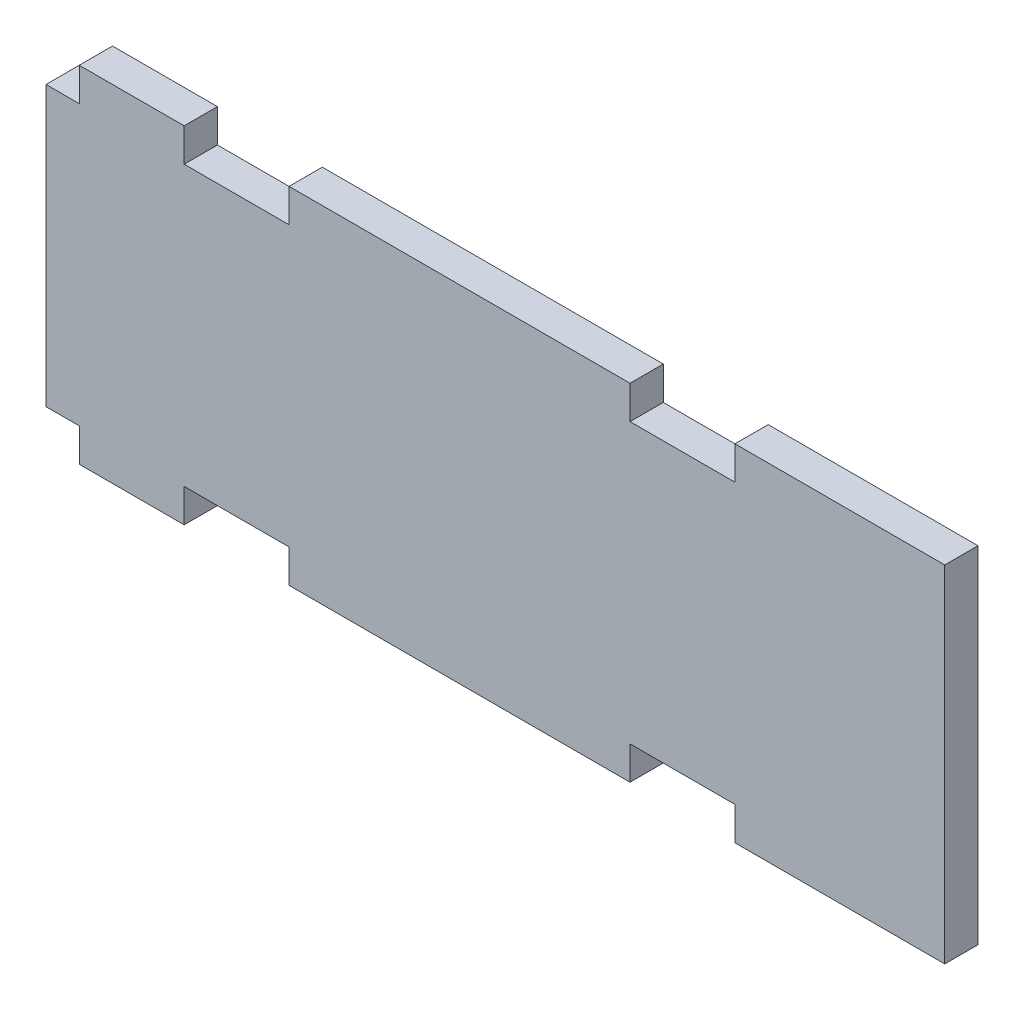
ISO-10303-21;
HEADER;
FILE_DESCRIPTION(('STEP AP214'),'2;1');
FILE_NAME('part.step','',(''),(''),'','','');
FILE_SCHEMA(('AUTOMOTIVE_DESIGN { 1 0 10303 214 1 1 1 1 }'));
ENDSEC;
DATA;
#1=APPLICATION_CONTEXT('core data for automotive mechanical design processes');
#2=APPLICATION_PROTOCOL_DEFINITION('international standard','automotive_design',2000,#1);
#3=PRODUCT_CONTEXT('',#1,'mechanical');
#4=PRODUCT('Part','Part','',(#3));
#5=PRODUCT_RELATED_PRODUCT_CATEGORY('part','',(#4));
#6=PRODUCT_DEFINITION_FORMATION('','',#4);
#7=PRODUCT_DEFINITION_CONTEXT('part definition',#1,'design');
#8=PRODUCT_DEFINITION('design','',#6,#7);
#9=PRODUCT_DEFINITION_SHAPE('','',#8);
#10=(LENGTH_UNIT() NAMED_UNIT(*) SI_UNIT(.MILLI.,.METRE.));
#11=(NAMED_UNIT(*) PLANE_ANGLE_UNIT() SI_UNIT($,.RADIAN.));
#12=(NAMED_UNIT(*) SI_UNIT($,.STERADIAN.) SOLID_ANGLE_UNIT());
#13=UNCERTAINTY_MEASURE_WITH_UNIT(LENGTH_MEASURE(1.E-05),#10,'distance_accuracy_value','');
#14=(GEOMETRIC_REPRESENTATION_CONTEXT(3) GLOBAL_UNCERTAINTY_ASSIGNED_CONTEXT((#13)) GLOBAL_UNIT_ASSIGNED_CONTEXT((#10,
#11,#12)) REPRESENTATION_CONTEXT('',''));
#15=CARTESIAN_POINT('',(0.,0.,0.));
#16=DIRECTION('',(0.,0.,1.));
#17=DIRECTION('',(1.,0.,0.));
#18=AXIS2_PLACEMENT_3D('',#15,#16,#17);
#19=CARTESIAN_POINT('',(3.16999999999997,0.,3.17));
#20=DIRECTION('',(-1.,0.,0.));
#21=DIRECTION('',(0.,-1.,0.));
#22=AXIS2_PLACEMENT_3D('',#19,#20,#21);
#23=PLANE('',#22);
#24=DIRECTION('',(0.,1.,0.));
#25=VECTOR('',#24,1.);
#26=CARTESIAN_POINT('',(3.16999999999997,0.,0.));
#27=LINE('',#26,#25);
#28=CARTESIAN_POINT('',(3.17000000000001,-32.94,0.));
#29=VERTEX_POINT('',#28);
#30=CARTESIAN_POINT('',(3.17,-29.77,0.));
#31=VERTEX_POINT('',#30);
#32=EDGE_CURVE('E225',#29,#31,#27,.T.);
#33=ORIENTED_EDGE('',*,*,#32,.F.);
#34=DIRECTION('',(0.,0.,-1.));
#35=VECTOR('',#34,1.);
#36=CARTESIAN_POINT('',(3.17000000000001,-32.94,3.17));
#37=LINE('',#36,#35);
#38=CARTESIAN_POINT('',(3.17000000000001,-32.94,3.17));
#39=VERTEX_POINT('',#38);
#40=EDGE_CURVE('E11',#39,#29,#37,.T.);
#41=ORIENTED_EDGE('',*,*,#40,.F.);
#42=DIRECTION('',(0.,1.,0.));
#43=VECTOR('',#42,1.);
#44=CARTESIAN_POINT('',(3.16999999999997,0.,3.17));
#45=LINE('',#44,#43);
#46=CARTESIAN_POINT('',(3.17,-29.77,3.17));
#47=VERTEX_POINT('',#46);
#48=EDGE_CURVE('E281',#39,#47,#45,.T.);
#49=ORIENTED_EDGE('',*,*,#48,.T.);
#50=DIRECTION('',(0.,0.,-1.));
#51=VECTOR('',#50,1.);
#52=CARTESIAN_POINT('',(3.17,-29.77,3.17));
#53=LINE('',#52,#51);
#54=EDGE_CURVE('E133',#47,#31,#53,.T.);
#55=ORIENTED_EDGE('',*,*,#54,.T.);
#56=EDGE_LOOP('',(#33,#41,#49,#55));
#57=FACE_BOUND('',#56,.T.);
#58=ADVANCED_FACE('F35',(#57),#23,.T.);
#59=CARTESIAN_POINT('',(0.,-32.94,3.17));
#60=DIRECTION('',(0.,1.,0.));
#61=DIRECTION('',(0.,0.,1.));
#62=AXIS2_PLACEMENT_3D('',#59,#60,#61);
#63=PLANE('',#62);
#64=DIRECTION('',(1.,0.,0.));
#65=VECTOR('',#64,1.);
#66=CARTESIAN_POINT('',(0.,-32.94,0.));
#67=LINE('',#66,#65);
#68=CARTESIAN_POINT('',(13.17,-32.94,0.));
#69=VERTEX_POINT('',#68);
#70=EDGE_CURVE('E228',#29,#69,#67,.T.);
#71=ORIENTED_EDGE('',*,*,#70,.T.);
#72=DIRECTION('',(0.,0.,-1.));
#73=VECTOR('',#72,1.);
#74=CARTESIAN_POINT('',(13.17,-32.94,3.17));
#75=LINE('',#74,#73);
#76=CARTESIAN_POINT('',(13.17,-32.94,3.17));
#77=VERTEX_POINT('',#76);
#78=EDGE_CURVE('E43',#77,#69,#75,.T.);
#79=ORIENTED_EDGE('',*,*,#78,.F.);
#80=DIRECTION('',(1.,0.,0.));
#81=VECTOR('',#80,1.);
#82=CARTESIAN_POINT('',(0.,-32.94,3.17));
#83=LINE('',#82,#81);
#84=EDGE_CURVE('E355',#39,#77,#83,.T.);
#85=ORIENTED_EDGE('',*,*,#84,.F.);
#86=ORIENTED_EDGE('',*,*,#40,.T.);
#87=EDGE_LOOP('',(#71,#79,#85,#86));
#88=FACE_BOUND('',#87,.T.);
#89=ADVANCED_FACE('F334',(#88),#63,.F.);
#90=CARTESIAN_POINT('',(13.17,0.,3.17));
#91=DIRECTION('',(1.,0.,0.));
#92=DIRECTION('',(0.,0.,-1.));
#93=AXIS2_PLACEMENT_3D('',#90,#91,#92);
#94=PLANE('',#93);
#95=DIRECTION('',(0.,-1.,0.));
#96=VECTOR('',#95,1.);
#97=CARTESIAN_POINT('',(13.17,0.,0.));
#98=LINE('',#97,#96);
#99=CARTESIAN_POINT('',(13.17,-29.77,0.));
#100=VERTEX_POINT('',#99);
#101=EDGE_CURVE('E231',#100,#69,#98,.T.);
#102=ORIENTED_EDGE('',*,*,#101,.F.);
#103=DIRECTION('',(0.,0.,-1.));
#104=VECTOR('',#103,1.);
#105=CARTESIAN_POINT('',(13.17,-29.77,3.17));
#106=LINE('',#105,#104);
#107=CARTESIAN_POINT('',(13.17,-29.77,3.17));
#108=VERTEX_POINT('',#107);
#109=EDGE_CURVE('E324',#108,#100,#106,.T.);
#110=ORIENTED_EDGE('',*,*,#109,.F.);
#111=DIRECTION('',(0.,-1.,0.));
#112=VECTOR('',#111,1.);
#113=CARTESIAN_POINT('',(13.17,0.,3.17));
#114=LINE('',#113,#112);
#115=EDGE_CURVE('E331',#108,#77,#114,.T.);
#116=ORIENTED_EDGE('',*,*,#115,.T.);
#117=ORIENTED_EDGE('',*,*,#78,.T.);
#118=EDGE_LOOP('',(#102,#110,#116,#117));
#119=FACE_BOUND('',#118,.T.);
#120=ADVANCED_FACE('F329',(#119),#94,.T.);
#121=CARTESIAN_POINT('',(0.,-29.77,3.17));
#122=DIRECTION('',(0.,1.,0.));
#123=DIRECTION('',(0.,0.,1.));
#124=AXIS2_PLACEMENT_3D('',#121,#122,#123);
#125=PLANE('',#124);
#126=DIRECTION('',(1.,0.,0.));
#127=VECTOR('',#126,1.);
#128=CARTESIAN_POINT('',(0.,-29.77,0.));
#129=LINE('',#128,#127);
#130=CARTESIAN_POINT('',(23.17,-29.77,0.));
#131=VERTEX_POINT('',#130);
#132=EDGE_CURVE('E236',#100,#131,#129,.T.);
#133=ORIENTED_EDGE('',*,*,#132,.T.);
#134=DIRECTION('',(0.,0.,-1.));
#135=VECTOR('',#134,1.);
#136=CARTESIAN_POINT('',(23.17,-29.77,3.17));
#137=LINE('',#136,#135);
#138=CARTESIAN_POINT('',(23.17,-29.77,3.17));
#139=VERTEX_POINT('',#138);
#140=EDGE_CURVE('E321',#139,#131,#137,.T.);
#141=ORIENTED_EDGE('',*,*,#140,.F.);
#142=DIRECTION('',(1.,0.,0.));
#143=VECTOR('',#142,1.);
#144=CARTESIAN_POINT('',(0.,-29.77,3.17));
#145=LINE('',#144,#143);
#146=EDGE_CURVE('E351',#108,#139,#145,.T.);
#147=ORIENTED_EDGE('',*,*,#146,.F.);
#148=ORIENTED_EDGE('',*,*,#109,.T.);
#149=EDGE_LOOP('',(#133,#141,#147,#148));
#150=FACE_BOUND('',#149,.T.);
#151=ADVANCED_FACE('F342',(#150),#125,.F.);
#152=CARTESIAN_POINT('',(23.17,0.,3.17));
#153=DIRECTION('',(1.,0.,0.));
#154=DIRECTION('',(0.,0.,-1.));
#155=AXIS2_PLACEMENT_3D('',#152,#153,#154);
#156=PLANE('',#155);
#157=DIRECTION('',(0.,-1.,0.));
#158=VECTOR('',#157,1.);
#159=CARTESIAN_POINT('',(23.17,0.,0.));
#160=LINE('',#159,#158);
#161=CARTESIAN_POINT('',(23.17,-32.94,0.));
#162=VERTEX_POINT('',#161);
#163=EDGE_CURVE('E238',#131,#162,#160,.T.);
#164=ORIENTED_EDGE('',*,*,#163,.T.);
#165=DIRECTION('',(0.,0.,-1.));
#166=VECTOR('',#165,1.);
#167=CARTESIAN_POINT('',(23.17,-32.94,3.17));
#168=LINE('',#167,#166);
#169=CARTESIAN_POINT('',(23.17,-32.94,3.17));
#170=VERTEX_POINT('',#169);
#171=EDGE_CURVE('E318',#170,#162,#168,.T.);
#172=ORIENTED_EDGE('',*,*,#171,.F.);
#173=DIRECTION('',(0.,-1.,0.));
#174=VECTOR('',#173,1.);
#175=CARTESIAN_POINT('',(23.17,0.,3.17));
#176=LINE('',#175,#174);
#177=EDGE_CURVE('E348',#139,#170,#176,.T.);
#178=ORIENTED_EDGE('',*,*,#177,.F.);
#179=ORIENTED_EDGE('',*,*,#140,.T.);
#180=EDGE_LOOP('',(#164,#172,#178,#179));
#181=FACE_BOUND('',#180,.T.);
#182=ADVANCED_FACE('F346',(#181),#156,.F.);
#183=CARTESIAN_POINT('',(55.67,-32.94,0.));
#184=VERTEX_POINT('',#183);
#185=EDGE_CURVE('E233',#162,#184,#67,.T.);
#186=ORIENTED_EDGE('',*,*,#185,.T.);
#187=DIRECTION('',(0.,0.,-1.));
#188=VECTOR('',#187,1.);
#189=CARTESIAN_POINT('',(55.67,-32.94,3.17));
#190=LINE('',#189,#188);
#191=CARTESIAN_POINT('',(55.67,-32.94,3.17));
#192=VERTEX_POINT('',#191);
#193=EDGE_CURVE('E316',#192,#184,#190,.T.);
#194=ORIENTED_EDGE('',*,*,#193,.F.);
#195=EDGE_CURVE('E350',#170,#192,#83,.T.);
#196=ORIENTED_EDGE('',*,*,#195,.F.);
#197=ORIENTED_EDGE('',*,*,#171,.T.);
#198=EDGE_LOOP('',(#186,#194,#196,#197));
#199=FACE_BOUND('',#198,.T.);
#200=ADVANCED_FACE('F434',(#199),#63,.F.);
#201=CARTESIAN_POINT('',(55.67,0.,3.17));
#202=DIRECTION('',(1.,0.,0.));
#203=DIRECTION('',(0.,0.,-1.));
#204=AXIS2_PLACEMENT_3D('',#201,#202,#203);
#205=PLANE('',#204);
#206=DIRECTION('',(0.,-1.,0.));
#207=VECTOR('',#206,1.);
#208=CARTESIAN_POINT('',(55.67,0.,0.));
#209=LINE('',#208,#207);
#210=CARTESIAN_POINT('',(55.67,-29.77,0.));
#211=VERTEX_POINT('',#210);
#212=EDGE_CURVE('E240',#211,#184,#209,.T.);
#213=ORIENTED_EDGE('',*,*,#212,.F.);
#214=DIRECTION('',(0.,0.,-1.));
#215=VECTOR('',#214,1.);
#216=CARTESIAN_POINT('',(55.67,-29.77,3.17));
#217=LINE('',#216,#215);
#218=CARTESIAN_POINT('',(55.67,-29.77,3.17));
#219=VERTEX_POINT('',#218);
#220=EDGE_CURVE('E314',#219,#211,#217,.T.);
#221=ORIENTED_EDGE('',*,*,#220,.F.);
#222=DIRECTION('',(0.,-1.,0.));
#223=VECTOR('',#222,1.);
#224=CARTESIAN_POINT('',(55.67,0.,3.17));
#225=LINE('',#224,#223);
#226=EDGE_CURVE('E353',#219,#192,#225,.T.);
#227=ORIENTED_EDGE('',*,*,#226,.T.);
#228=ORIENTED_EDGE('',*,*,#193,.T.);
#229=EDGE_LOOP('',(#213,#221,#227,#228));
#230=FACE_BOUND('',#229,.T.);
#231=ADVANCED_FACE('F466',(#230),#205,.T.);
#232=CARTESIAN_POINT('',(0.,-29.77,3.17));
#233=DIRECTION('',(0.,1.,0.));
#234=DIRECTION('',(0.,0.,1.));
#235=AXIS2_PLACEMENT_3D('',#232,#233,#234);
#236=PLANE('',#235);
#237=DIRECTION('',(1.,0.,0.));
#238=VECTOR('',#237,1.);
#239=CARTESIAN_POINT('',(0.,-29.77,0.));
#240=LINE('',#239,#238);
#241=CARTESIAN_POINT('',(65.67,-29.77,0.));
#242=VERTEX_POINT('',#241);
#243=EDGE_CURVE('E243',#211,#242,#240,.T.);
#244=ORIENTED_EDGE('',*,*,#243,.T.);
#245=DIRECTION('',(0.,0.,-1.));
#246=VECTOR('',#245,1.);
#247=CARTESIAN_POINT('',(65.67,-29.77,3.17));
#248=LINE('',#247,#246);
#249=CARTESIAN_POINT('',(65.67,-29.77,3.17));
#250=VERTEX_POINT('',#249);
#251=EDGE_CURVE('E311',#250,#242,#248,.T.);
#252=ORIENTED_EDGE('',*,*,#251,.F.);
#253=DIRECTION('',(1.,0.,0.));
#254=VECTOR('',#253,1.);
#255=CARTESIAN_POINT('',(0.,-29.77,3.17));
#256=LINE('',#255,#254);
#257=EDGE_CURVE('E362',#219,#250,#256,.T.);
#258=ORIENTED_EDGE('',*,*,#257,.F.);
#259=ORIENTED_EDGE('',*,*,#220,.T.);
#260=EDGE_LOOP('',(#244,#252,#258,#259));
#261=FACE_BOUND('',#260,.T.);
#262=ADVANCED_FACE('F471',(#261),#236,.F.);
#263=CARTESIAN_POINT('',(65.67,0.,3.17));
#264=DIRECTION('',(1.,0.,0.));
#265=DIRECTION('',(0.,0.,-1.));
#266=AXIS2_PLACEMENT_3D('',#263,#264,#265);
#267=PLANE('',#266);
#268=DIRECTION('',(0.,-1.,0.));
#269=VECTOR('',#268,1.);
#270=CARTESIAN_POINT('',(65.67,0.,0.));
#271=LINE('',#270,#269);
#272=CARTESIAN_POINT('',(65.67,-32.94,0.));
#273=VERTEX_POINT('',#272);
#274=EDGE_CURVE('E245',#242,#273,#271,.T.);
#275=ORIENTED_EDGE('',*,*,#274,.T.);
#276=DIRECTION('',(0.,0.,-1.));
#277=VECTOR('',#276,1.);
#278=CARTESIAN_POINT('',(65.67,-32.94,3.17));
#279=LINE('',#278,#277);
#280=CARTESIAN_POINT('',(65.67,-32.94,3.17));
#281=VERTEX_POINT('',#280);
#282=EDGE_CURVE('E308',#281,#273,#279,.T.);
#283=ORIENTED_EDGE('',*,*,#282,.F.);
#284=DIRECTION('',(0.,-1.,0.));
#285=VECTOR('',#284,1.);
#286=CARTESIAN_POINT('',(65.67,0.,3.17));
#287=LINE('',#286,#285);
#288=EDGE_CURVE('E364',#250,#281,#287,.T.);
#289=ORIENTED_EDGE('',*,*,#288,.F.);
#290=ORIENTED_EDGE('',*,*,#251,.T.);
#291=EDGE_LOOP('',(#275,#283,#289,#290));
#292=FACE_BOUND('',#291,.T.);
#293=ADVANCED_FACE('F473',(#292),#267,.F.);
#294=CARTESIAN_POINT('',(85.67,-32.94,0.));
#295=VERTEX_POINT('',#294);
#296=EDGE_CURVE('E232',#273,#295,#67,.T.);
#297=ORIENTED_EDGE('',*,*,#296,.T.);
#298=DIRECTION('',(0.,0.,-1.));
#299=VECTOR('',#298,1.);
#300=CARTESIAN_POINT('',(85.67,-32.94,3.17));
#301=LINE('',#300,#299);
#302=CARTESIAN_POINT('',(85.67,-32.94,3.17));
#303=VERTEX_POINT('',#302);
#304=EDGE_CURVE('E305',#303,#295,#301,.T.);
#305=ORIENTED_EDGE('',*,*,#304,.F.);
#306=EDGE_CURVE('E356',#281,#303,#83,.T.);
#307=ORIENTED_EDGE('',*,*,#306,.F.);
#308=ORIENTED_EDGE('',*,*,#282,.T.);
#309=EDGE_LOOP('',(#297,#305,#307,#308));
#310=FACE_BOUND('',#309,.T.);
#311=ADVANCED_FACE('F435',(#310),#63,.F.);
#312=CARTESIAN_POINT('',(85.67,0.,3.17));
#313=DIRECTION('',(-1.,0.,0.));
#314=DIRECTION('',(0.,0.,1.));
#315=AXIS2_PLACEMENT_3D('',#312,#313,#314);
#316=PLANE('',#315);
#317=DIRECTION('',(0.,1.,0.));
#318=VECTOR('',#317,1.);
#319=CARTESIAN_POINT('',(85.67,0.,0.));
#320=LINE('',#319,#318);
#321=CARTESIAN_POINT('',(85.67,0.,0.));
#322=VERTEX_POINT('',#321);
#323=EDGE_CURVE('E247',#295,#322,#320,.T.);
#324=ORIENTED_EDGE('',*,*,#323,.T.);
#325=DIRECTION('',(0.,0.,-1.));
#326=VECTOR('',#325,1.);
#327=CARTESIAN_POINT('',(85.67,0.,3.17));
#328=LINE('',#327,#326);
#329=CARTESIAN_POINT('',(85.67,0.,3.17));
#330=VERTEX_POINT('',#329);
#331=EDGE_CURVE('E303',#330,#322,#328,.T.);
#332=ORIENTED_EDGE('',*,*,#331,.F.);
#333=DIRECTION('',(0.,1.,0.));
#334=VECTOR('',#333,1.);
#335=CARTESIAN_POINT('',(85.67,0.,3.17));
#336=LINE('',#335,#334);
#337=EDGE_CURVE('E366',#303,#330,#336,.T.);
#338=ORIENTED_EDGE('',*,*,#337,.F.);
#339=ORIENTED_EDGE('',*,*,#304,.T.);
#340=EDGE_LOOP('',(#324,#332,#338,#339));
#341=FACE_BOUND('',#340,.T.);
#342=ADVANCED_FACE('F449',(#341),#316,.F.);
#343=CARTESIAN_POINT('',(0.,0.,3.17));
#344=DIRECTION('',(0.,1.,0.));
#345=DIRECTION('',(0.,0.,1.));
#346=AXIS2_PLACEMENT_3D('',#343,#344,#345);
#347=PLANE('',#346);
#348=DIRECTION('',(1.,0.,0.));
#349=VECTOR('',#348,1.);
#350=CARTESIAN_POINT('',(0.,0.,0.));
#351=LINE('',#350,#349);
#352=CARTESIAN_POINT('',(65.67,0.,0.));
#353=VERTEX_POINT('',#352);
#354=EDGE_CURVE('E250',#353,#322,#351,.T.);
#355=ORIENTED_EDGE('',*,*,#354,.F.);
#356=DIRECTION('',(0.,0.,-1.));
#357=VECTOR('',#356,1.);
#358=CARTESIAN_POINT('',(65.67,0.,3.17));
#359=LINE('',#358,#357);
#360=CARTESIAN_POINT('',(65.67,0.,3.17));
#361=VERTEX_POINT('',#360);
#362=EDGE_CURVE('E301',#361,#353,#359,.T.);
#363=ORIENTED_EDGE('',*,*,#362,.F.);
#364=DIRECTION('',(1.,0.,0.));
#365=VECTOR('',#364,1.);
#366=CARTESIAN_POINT('',(0.,0.,3.17));
#367=LINE('',#366,#365);
#368=EDGE_CURVE('E368',#361,#330,#367,.T.);
#369=ORIENTED_EDGE('',*,*,#368,.T.);
#370=ORIENTED_EDGE('',*,*,#331,.T.);
#371=EDGE_LOOP('',(#355,#363,#369,#370));
#372=FACE_BOUND('',#371,.T.);
#373=ADVANCED_FACE('F427',(#372),#347,.T.);
#374=CARTESIAN_POINT('',(65.67,0.,3.17));
#375=DIRECTION('',(1.,0.,0.));
#376=DIRECTION('',(0.,0.,-1.));
#377=AXIS2_PLACEMENT_3D('',#374,#375,#376);
#378=PLANE('',#377);
#379=DIRECTION('',(0.,-1.,0.));
#380=VECTOR('',#379,1.);
#381=CARTESIAN_POINT('',(65.67,0.,0.));
#382=LINE('',#381,#380);
#383=CARTESIAN_POINT('',(65.67,-3.17,0.));
#384=VERTEX_POINT('',#383);
#385=EDGE_CURVE('E253',#353,#384,#382,.T.);
#386=ORIENTED_EDGE('',*,*,#385,.T.);
#387=DIRECTION('',(0.,0.,-1.));
#388=VECTOR('',#387,1.);
#389=CARTESIAN_POINT('',(65.67,-3.17,3.17));
#390=LINE('',#389,#388);
#391=CARTESIAN_POINT('',(65.67,-3.17,3.17));
#392=VERTEX_POINT('',#391);
#393=EDGE_CURVE('E299',#392,#384,#390,.T.);
#394=ORIENTED_EDGE('',*,*,#393,.F.);
#395=DIRECTION('',(0.,-1.,0.));
#396=VECTOR('',#395,1.);
#397=CARTESIAN_POINT('',(65.67,0.,3.17));
#398=LINE('',#397,#396);
#399=EDGE_CURVE('E371',#361,#392,#398,.T.);
#400=ORIENTED_EDGE('',*,*,#399,.F.);
#401=ORIENTED_EDGE('',*,*,#362,.T.);
#402=EDGE_LOOP('',(#386,#394,#400,#401));
#403=FACE_BOUND('',#402,.T.);
#404=ADVANCED_FACE('F455',(#403),#378,.F.);
#405=CARTESIAN_POINT('',(0.,-3.17,3.17));
#406=DIRECTION('',(0.,1.,0.));
#407=DIRECTION('',(0.,0.,1.));
#408=AXIS2_PLACEMENT_3D('',#405,#406,#407);
#409=PLANE('',#408);
#410=DIRECTION('',(1.,0.,0.));
#411=VECTOR('',#410,1.);
#412=CARTESIAN_POINT('',(0.,-3.17,0.));
#413=LINE('',#412,#411);
#414=CARTESIAN_POINT('',(55.67,-3.17,0.));
#415=VERTEX_POINT('',#414);
#416=EDGE_CURVE('E258',#415,#384,#413,.T.);
#417=ORIENTED_EDGE('',*,*,#416,.F.);
#418=DIRECTION('',(0.,0.,-1.));
#419=VECTOR('',#418,1.);
#420=CARTESIAN_POINT('',(55.67,-3.17,3.17));
#421=LINE('',#420,#419);
#422=CARTESIAN_POINT('',(55.67,-3.17,3.17));
#423=VERTEX_POINT('',#422);
#424=EDGE_CURVE('E297',#423,#415,#421,.T.);
#425=ORIENTED_EDGE('',*,*,#424,.F.);
#426=DIRECTION('',(1.,0.,0.));
#427=VECTOR('',#426,1.);
#428=CARTESIAN_POINT('',(0.,-3.17,3.17));
#429=LINE('',#428,#427);
#430=EDGE_CURVE('E375',#423,#392,#429,.T.);
#431=ORIENTED_EDGE('',*,*,#430,.T.);
#432=ORIENTED_EDGE('',*,*,#393,.T.);
#433=EDGE_LOOP('',(#417,#425,#431,#432));
#434=FACE_BOUND('',#433,.T.);
#435=ADVANCED_FACE('F458',(#434),#409,.T.);
#436=CARTESIAN_POINT('',(55.67,0.,3.17));
#437=DIRECTION('',(1.,0.,0.));
#438=DIRECTION('',(0.,0.,-1.));
#439=AXIS2_PLACEMENT_3D('',#436,#437,#438);
#440=PLANE('',#439);
#441=DIRECTION('',(0.,-1.,0.));
#442=VECTOR('',#441,1.);
#443=CARTESIAN_POINT('',(55.67,0.,0.));
#444=LINE('',#443,#442);
#445=CARTESIAN_POINT('',(55.67,0.,0.));
#446=VERTEX_POINT('',#445);
#447=EDGE_CURVE('E261',#446,#415,#444,.T.);
#448=ORIENTED_EDGE('',*,*,#447,.F.);
#449=DIRECTION('',(0.,0.,-1.));
#450=VECTOR('',#449,1.);
#451=CARTESIAN_POINT('',(55.67,0.,3.17));
#452=LINE('',#451,#450);
#453=CARTESIAN_POINT('',(55.67,0.,3.17));
#454=VERTEX_POINT('',#453);
#455=EDGE_CURVE('E295',#454,#446,#452,.T.);
#456=ORIENTED_EDGE('',*,*,#455,.F.);
#457=DIRECTION('',(0.,-1.,0.));
#458=VECTOR('',#457,1.);
#459=CARTESIAN_POINT('',(55.67,0.,3.17));
#460=LINE('',#459,#458);
#461=EDGE_CURVE('E378',#454,#423,#460,.T.);
#462=ORIENTED_EDGE('',*,*,#461,.T.);
#463=ORIENTED_EDGE('',*,*,#424,.T.);
#464=EDGE_LOOP('',(#448,#456,#462,#463));
#465=FACE_BOUND('',#464,.T.);
#466=ADVANCED_FACE('F402',(#465),#440,.T.);
#467=CARTESIAN_POINT('',(23.17,0.,0.));
#468=VERTEX_POINT('',#467);
#469=EDGE_CURVE('E255',#468,#446,#351,.T.);
#470=ORIENTED_EDGE('',*,*,#469,.F.);
#471=DIRECTION('',(0.,0.,-1.));
#472=VECTOR('',#471,1.);
#473=CARTESIAN_POINT('',(23.17,0.,3.17));
#474=LINE('',#473,#472);
#475=CARTESIAN_POINT('',(23.17,0.,3.17));
#476=VERTEX_POINT('',#475);
#477=EDGE_CURVE('E293',#476,#468,#474,.T.);
#478=ORIENTED_EDGE('',*,*,#477,.F.);
#479=EDGE_CURVE('E373',#476,#454,#367,.T.);
#480=ORIENTED_EDGE('',*,*,#479,.T.);
#481=ORIENTED_EDGE('',*,*,#455,.T.);
#482=EDGE_LOOP('',(#470,#478,#480,#481));
#483=FACE_BOUND('',#482,.T.);
#484=ADVANCED_FACE('F394',(#483),#347,.T.);
#485=CARTESIAN_POINT('',(23.17,0.,3.17));
#486=DIRECTION('',(1.,0.,0.));
#487=DIRECTION('',(0.,1.,0.));
#488=AXIS2_PLACEMENT_3D('',#485,#486,#487);
#489=PLANE('',#488);
#490=DIRECTION('',(0.,-1.,0.));
#491=VECTOR('',#490,1.);
#492=CARTESIAN_POINT('',(23.17,0.,0.));
#493=LINE('',#492,#491);
#494=CARTESIAN_POINT('',(23.17,-3.17,0.));
#495=VERTEX_POINT('',#494);
#496=EDGE_CURVE('E264',#468,#495,#493,.T.);
#497=ORIENTED_EDGE('',*,*,#496,.T.);
#498=DIRECTION('',(0.,0.,-1.));
#499=VECTOR('',#498,1.);
#500=CARTESIAN_POINT('',(23.17,-3.17,3.17));
#501=LINE('',#500,#499);
#502=CARTESIAN_POINT('',(23.17,-3.17,3.17));
#503=VERTEX_POINT('',#502);
#504=EDGE_CURVE('E291',#503,#495,#501,.T.);
#505=ORIENTED_EDGE('',*,*,#504,.F.);
#506=DIRECTION('',(0.,-1.,0.));
#507=VECTOR('',#506,1.);
#508=CARTESIAN_POINT('',(23.17,0.,3.17));
#509=LINE('',#508,#507);
#510=EDGE_CURVE('E381',#476,#503,#509,.T.);
#511=ORIENTED_EDGE('',*,*,#510,.F.);
#512=ORIENTED_EDGE('',*,*,#477,.T.);
#513=EDGE_LOOP('',(#497,#505,#511,#512));
#514=FACE_BOUND('',#513,.T.);
#515=ADVANCED_FACE('F418',(#514),#489,.F.);
#516=CARTESIAN_POINT('',(0.,-3.17,3.17));
#517=DIRECTION('',(0.,1.,0.));
#518=DIRECTION('',(0.,0.,1.));
#519=AXIS2_PLACEMENT_3D('',#516,#517,#518);
#520=PLANE('',#519);
#521=DIRECTION('',(1.,0.,0.));
#522=VECTOR('',#521,1.);
#523=CARTESIAN_POINT('',(0.,-3.17,0.));
#524=LINE('',#523,#522);
#525=CARTESIAN_POINT('',(13.17,-3.17,0.));
#526=VERTEX_POINT('',#525);
#527=EDGE_CURVE('E267',#526,#495,#524,.T.);
#528=ORIENTED_EDGE('',*,*,#527,.F.);
#529=DIRECTION('',(0.,0.,-1.));
#530=VECTOR('',#529,1.);
#531=CARTESIAN_POINT('',(13.17,-3.17,3.17));
#532=LINE('',#531,#530);
#533=CARTESIAN_POINT('',(13.17,-3.17,3.17));
#534=VERTEX_POINT('',#533);
#535=EDGE_CURVE('E289',#534,#526,#532,.T.);
#536=ORIENTED_EDGE('',*,*,#535,.F.);
#537=DIRECTION('',(1.,0.,0.));
#538=VECTOR('',#537,1.);
#539=CARTESIAN_POINT('',(0.,-3.17,3.17));
#540=LINE('',#539,#538);
#541=EDGE_CURVE('E383',#534,#503,#540,.T.);
#542=ORIENTED_EDGE('',*,*,#541,.T.);
#543=ORIENTED_EDGE('',*,*,#504,.T.);
#544=EDGE_LOOP('',(#528,#536,#542,#543));
#545=FACE_BOUND('',#544,.T.);
#546=ADVANCED_FACE('F416',(#545),#520,.T.);
#547=CARTESIAN_POINT('',(13.17,0.,3.17));
#548=DIRECTION('',(1.,0.,0.));
#549=DIRECTION('',(0.,1.,0.));
#550=AXIS2_PLACEMENT_3D('',#547,#548,#549);
#551=PLANE('',#550);
#552=DIRECTION('',(0.,-1.,0.));
#553=VECTOR('',#552,1.);
#554=CARTESIAN_POINT('',(13.17,0.,0.));
#555=LINE('',#554,#553);
#556=CARTESIAN_POINT('',(13.17,0.,0.));
#557=VERTEX_POINT('',#556);
#558=EDGE_CURVE('E270',#557,#526,#555,.T.);
#559=ORIENTED_EDGE('',*,*,#558,.F.);
#560=DIRECTION('',(0.,0.,-1.));
#561=VECTOR('',#560,1.);
#562=CARTESIAN_POINT('',(13.17,0.,3.17));
#563=LINE('',#562,#561);
#564=CARTESIAN_POINT('',(13.17,0.,3.17));
#565=VERTEX_POINT('',#564);
#566=EDGE_CURVE('E287',#565,#557,#563,.T.);
#567=ORIENTED_EDGE('',*,*,#566,.F.);
#568=DIRECTION('',(0.,-1.,0.));
#569=VECTOR('',#568,1.);
#570=CARTESIAN_POINT('',(13.17,0.,3.17));
#571=LINE('',#570,#569);
#572=EDGE_CURVE('E386',#565,#534,#571,.T.);
#573=ORIENTED_EDGE('',*,*,#572,.T.);
#574=ORIENTED_EDGE('',*,*,#535,.T.);
#575=EDGE_LOOP('',(#559,#567,#573,#574));
#576=FACE_BOUND('',#575,.T.);
#577=ADVANCED_FACE('F413',(#576),#551,.T.);
#578=CARTESIAN_POINT('',(3.17,0.,0.));
#579=VERTEX_POINT('',#578);
#580=EDGE_CURVE('E254',#579,#557,#351,.T.);
#581=ORIENTED_EDGE('',*,*,#580,.F.);
#582=DIRECTION('',(0.,0.,-1.));
#583=VECTOR('',#582,1.);
#584=CARTESIAN_POINT('',(3.17,0.,3.17));
#585=LINE('',#584,#583);
#586=CARTESIAN_POINT('',(3.17,0.,3.17));
#587=VERTEX_POINT('',#586);
#588=EDGE_CURVE('E285',#587,#579,#585,.T.);
#589=ORIENTED_EDGE('',*,*,#588,.F.);
#590=EDGE_CURVE('E372',#587,#565,#367,.T.);
#591=ORIENTED_EDGE('',*,*,#590,.T.);
#592=ORIENTED_EDGE('',*,*,#566,.T.);
#593=EDGE_LOOP('',(#581,#589,#591,#592));
#594=FACE_BOUND('',#593,.T.);
#595=ADVANCED_FACE('F410',(#594),#347,.T.);
#596=CARTESIAN_POINT('',(3.17,0.,3.17));
#597=DIRECTION('',(1.,0.,0.));
#598=DIRECTION('',(0.,0.,-1.));
#599=AXIS2_PLACEMENT_3D('',#596,#597,#598);
#600=PLANE('',#599);
#601=DIRECTION('',(0.,-1.,0.));
#602=VECTOR('',#601,1.);
#603=CARTESIAN_POINT('',(3.17,0.,0.));
#604=LINE('',#603,#602);
#605=CARTESIAN_POINT('',(3.17,-3.17,0.));
#606=VERTEX_POINT('',#605);
#607=EDGE_CURVE('E273',#579,#606,#604,.T.);
#608=ORIENTED_EDGE('',*,*,#607,.T.);
#609=DIRECTION('',(0.,0.,-1.));
#610=VECTOR('',#609,1.);
#611=CARTESIAN_POINT('',(3.17,-3.17,3.17));
#612=LINE('',#611,#610);
#613=CARTESIAN_POINT('',(3.17,-3.17,3.17));
#614=VERTEX_POINT('',#613);
#615=EDGE_CURVE('E211',#614,#606,#612,.T.);
#616=ORIENTED_EDGE('',*,*,#615,.F.);
#617=DIRECTION('',(0.,-1.,0.));
#618=VECTOR('',#617,1.);
#619=CARTESIAN_POINT('',(3.17,0.,3.17));
#620=LINE('',#619,#618);
#621=EDGE_CURVE('E217',#587,#614,#620,.T.);
#622=ORIENTED_EDGE('',*,*,#621,.F.);
#623=ORIENTED_EDGE('',*,*,#588,.T.);
#624=EDGE_LOOP('',(#608,#616,#622,#623));
#625=FACE_BOUND('',#624,.T.);
#626=ADVANCED_FACE('F594',(#625),#600,.F.);
#627=CARTESIAN_POINT('',(0.,-3.17,3.17));
#628=DIRECTION('',(0.,1.,0.));
#629=DIRECTION('',(0.,0.,1.));
#630=AXIS2_PLACEMENT_3D('',#627,#628,#629);
#631=PLANE('',#630);
#632=DIRECTION('',(1.,0.,0.));
#633=VECTOR('',#632,1.);
#634=CARTESIAN_POINT('',(0.,-3.17,0.));
#635=LINE('',#634,#633);
#636=CARTESIAN_POINT('',(0.,-3.17,0.));
#637=VERTEX_POINT('',#636);
#638=EDGE_CURVE('E206',#637,#606,#635,.T.);
#639=ORIENTED_EDGE('',*,*,#638,.F.);
#640=DIRECTION('',(0.,0.,-1.));
#641=VECTOR('',#640,1.);
#642=CARTESIAN_POINT('',(0.,-3.17,3.17));
#643=LINE('',#642,#641);
#644=CARTESIAN_POINT('',(0.,-3.17,3.17));
#645=VERTEX_POINT('',#644);
#646=EDGE_CURVE('E201',#645,#637,#643,.T.);
#647=ORIENTED_EDGE('',*,*,#646,.F.);
#648=DIRECTION('',(1.,0.,0.));
#649=VECTOR('',#648,1.);
#650=CARTESIAN_POINT('',(0.,-3.17,3.17));
#651=LINE('',#650,#649);
#652=EDGE_CURVE('E204',#645,#614,#651,.T.);
#653=ORIENTED_EDGE('',*,*,#652,.T.);
#654=ORIENTED_EDGE('',*,*,#615,.T.);
#655=EDGE_LOOP('',(#639,#647,#653,#654));
#656=FACE_BOUND('',#655,.T.);
#657=ADVANCED_FACE('F203',(#656),#631,.T.);
#658=CARTESIAN_POINT('',(0.,0.,3.17));
#659=DIRECTION('',(-1.,0.,0.));
#660=DIRECTION('',(0.,-1.,0.));
#661=AXIS2_PLACEMENT_3D('',#658,#659,#660);
#662=PLANE('',#661);
#663=DIRECTION('',(0.,1.,0.));
#664=VECTOR('',#663,1.);
#665=CARTESIAN_POINT('',(0.,0.,0.));
#666=LINE('',#665,#664);
#667=CARTESIAN_POINT('',(0.,-29.77,0.));
#668=VERTEX_POINT('',#667);
#669=EDGE_CURVE('E277',#668,#637,#666,.T.);
#670=ORIENTED_EDGE('',*,*,#669,.F.);
#671=DIRECTION('',(0.,0.,-1.));
#672=VECTOR('',#671,1.);
#673=CARTESIAN_POINT('',(0.,-29.77,3.17));
#674=LINE('',#673,#672);
#675=CARTESIAN_POINT('',(0.,-29.77,3.17));
#676=VERTEX_POINT('',#675);
#677=EDGE_CURVE('E126',#676,#668,#674,.T.);
#678=ORIENTED_EDGE('',*,*,#677,.F.);
#679=DIRECTION('',(0.,1.,0.));
#680=VECTOR('',#679,1.);
#681=CARTESIAN_POINT('',(0.,0.,3.17));
#682=LINE('',#681,#680);
#683=EDGE_CURVE('E214',#676,#645,#682,.T.);
#684=ORIENTED_EDGE('',*,*,#683,.T.);
#685=ORIENTED_EDGE('',*,*,#646,.T.);
#686=EDGE_LOOP('',(#670,#678,#684,#685));
#687=FACE_BOUND('',#686,.T.);
#688=ADVANCED_FACE('F220',(#687),#662,.T.);
#689=CARTESIAN_POINT('',(0.,-29.77,3.17));
#690=DIRECTION('',(0.,1.,0.));
#691=DIRECTION('',(0.,0.,1.));
#692=AXIS2_PLACEMENT_3D('',#689,#690,#691);
#693=PLANE('',#692);
#694=DIRECTION('',(1.,0.,0.));
#695=VECTOR('',#694,1.);
#696=CARTESIAN_POINT('',(0.,-29.77,0.));
#697=LINE('',#696,#695);
#698=EDGE_CURVE('E279',#668,#31,#697,.T.);
#699=ORIENTED_EDGE('',*,*,#698,.T.);
#700=ORIENTED_EDGE('',*,*,#54,.F.);
#701=DIRECTION('',(1.,0.,0.));
#702=VECTOR('',#701,1.);
#703=CARTESIAN_POINT('',(0.,-29.77,3.17));
#704=LINE('',#703,#702);
#705=EDGE_CURVE('E51',#676,#47,#704,.T.);
#706=ORIENTED_EDGE('',*,*,#705,.F.);
#707=ORIENTED_EDGE('',*,*,#677,.T.);
#708=EDGE_LOOP('',(#699,#700,#706,#707));
#709=FACE_BOUND('',#708,.T.);
#710=ADVANCED_FACE('F436',(#709),#693,.F.);
#711=CARTESIAN_POINT('',(0.,0.,3.17));
#712=DIRECTION('',(0.,0.,1.));
#713=DIRECTION('',(1.,0.,0.));
#714=AXIS2_PLACEMENT_3D('',#711,#712,#713);
#715=PLANE('',#714);
#716=ORIENTED_EDGE('',*,*,#48,.F.);
#717=ORIENTED_EDGE('',*,*,#84,.T.);
#718=ORIENTED_EDGE('',*,*,#115,.F.);
#719=ORIENTED_EDGE('',*,*,#146,.T.);
#720=ORIENTED_EDGE('',*,*,#177,.T.);
#721=ORIENTED_EDGE('',*,*,#195,.T.);
#722=ORIENTED_EDGE('',*,*,#226,.F.);
#723=ORIENTED_EDGE('',*,*,#257,.T.);
#724=ORIENTED_EDGE('',*,*,#288,.T.);
#725=ORIENTED_EDGE('',*,*,#306,.T.);
#726=ORIENTED_EDGE('',*,*,#337,.T.);
#727=ORIENTED_EDGE('',*,*,#368,.F.);
#728=ORIENTED_EDGE('',*,*,#399,.T.);
#729=ORIENTED_EDGE('',*,*,#430,.F.);
#730=ORIENTED_EDGE('',*,*,#461,.F.);
#731=ORIENTED_EDGE('',*,*,#479,.F.);
#732=ORIENTED_EDGE('',*,*,#510,.T.);
#733=ORIENTED_EDGE('',*,*,#541,.F.);
#734=ORIENTED_EDGE('',*,*,#572,.F.);
#735=ORIENTED_EDGE('',*,*,#590,.F.);
#736=ORIENTED_EDGE('',*,*,#621,.T.);
#737=ORIENTED_EDGE('',*,*,#652,.F.);
#738=ORIENTED_EDGE('',*,*,#683,.F.);
#739=ORIENTED_EDGE('',*,*,#705,.T.);
#740=EDGE_LOOP('',(#716,#717,#718,#719,#720,#721,#722,#723,#724,#725,#726,#727,#728,#729,#730,
#731,#732,#733,#734,#735,#736,#737,#738,#739));
#741=FACE_BOUND('',#740,.T.);
#742=ADVANCED_FACE('F213',(#741),#715,.T.);
#743=CARTESIAN_POINT('',(0.,0.,0.));
#744=DIRECTION('',(0.,0.,1.));
#745=DIRECTION('',(1.,0.,0.));
#746=AXIS2_PLACEMENT_3D('',#743,#744,#745);
#747=PLANE('',#746);
#748=ORIENTED_EDGE('',*,*,#32,.T.);
#749=ORIENTED_EDGE('',*,*,#698,.F.);
#750=ORIENTED_EDGE('',*,*,#669,.T.);
#751=ORIENTED_EDGE('',*,*,#638,.T.);
#752=ORIENTED_EDGE('',*,*,#607,.F.);
#753=ORIENTED_EDGE('',*,*,#580,.T.);
#754=ORIENTED_EDGE('',*,*,#558,.T.);
#755=ORIENTED_EDGE('',*,*,#527,.T.);
#756=ORIENTED_EDGE('',*,*,#496,.F.);
#757=ORIENTED_EDGE('',*,*,#469,.T.);
#758=ORIENTED_EDGE('',*,*,#447,.T.);
#759=ORIENTED_EDGE('',*,*,#416,.T.);
#760=ORIENTED_EDGE('',*,*,#385,.F.);
#761=ORIENTED_EDGE('',*,*,#354,.T.);
#762=ORIENTED_EDGE('',*,*,#323,.F.);
#763=ORIENTED_EDGE('',*,*,#296,.F.);
#764=ORIENTED_EDGE('',*,*,#274,.F.);
#765=ORIENTED_EDGE('',*,*,#243,.F.);
#766=ORIENTED_EDGE('',*,*,#212,.T.);
#767=ORIENTED_EDGE('',*,*,#185,.F.);
#768=ORIENTED_EDGE('',*,*,#163,.F.);
#769=ORIENTED_EDGE('',*,*,#132,.F.);
#770=ORIENTED_EDGE('',*,*,#101,.T.);
#771=ORIENTED_EDGE('',*,*,#70,.F.);
#772=EDGE_LOOP('',(#748,#749,#750,#751,#752,#753,#754,#755,#756,#757,#758,#759,#760,#761,#762,
#763,#764,#765,#766,#767,#768,#769,#770,#771));
#773=FACE_BOUND('',#772,.T.);
#774=ADVANCED_FACE('F337',(#773),#747,.F.);
#775=CLOSED_SHELL('',(#58,#89,#120,#151,#182,#200,#231,#262,#293,#311,#342,#373,#404,#435,#466,
#484,#515,#546,#577,#595,#626,#657,#688,#710,#742,#774));
#776=MANIFOLD_SOLID_BREP('B2',#775);
#777=ADVANCED_BREP_SHAPE_REPRESENTATION('',(#18,#776),#14);
#778=SHAPE_DEFINITION_REPRESENTATION(#9,#777);
ENDSEC;
END-ISO-10303-21;
